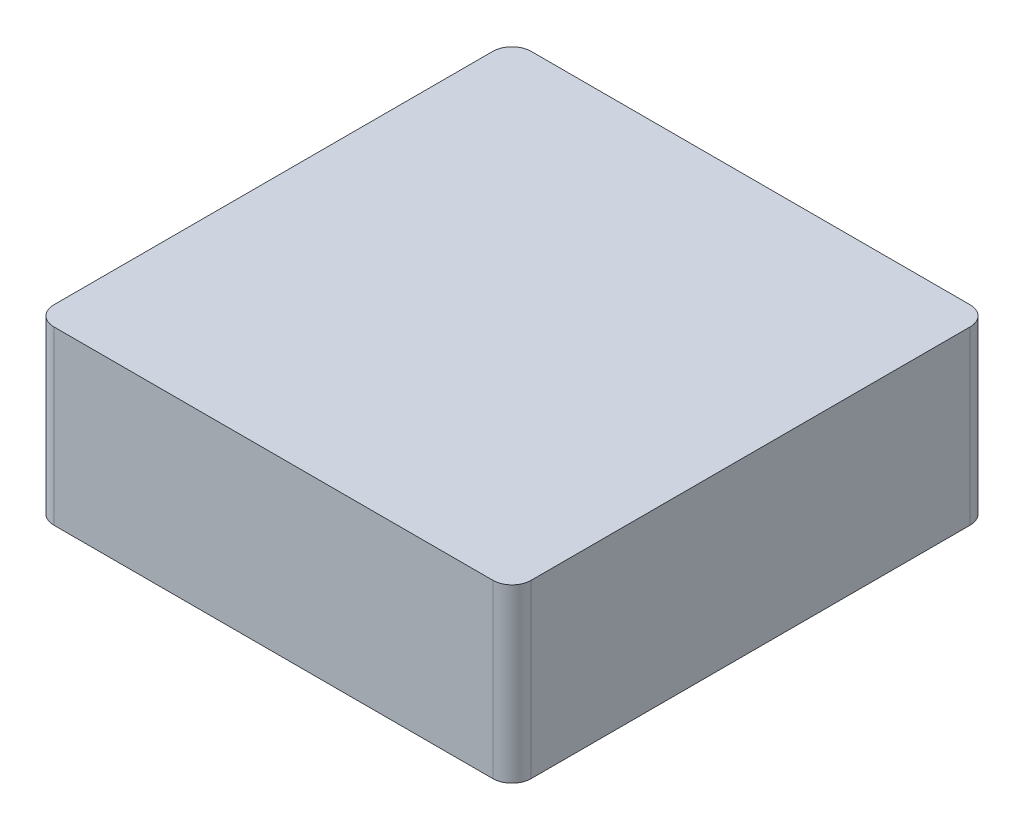
ISO-10303-21;
HEADER;
FILE_DESCRIPTION(('STEP AP214'),'2;1');
FILE_NAME('part.step','',(''),(''),'','','');
FILE_SCHEMA(('AUTOMOTIVE_DESIGN { 1 0 10303 214 1 1 1 1 }'));
ENDSEC;
DATA;
#1=APPLICATION_CONTEXT('core data for automotive mechanical design processes');
#2=APPLICATION_PROTOCOL_DEFINITION('international standard','automotive_design',2000,#1);
#3=PRODUCT_CONTEXT('',#1,'mechanical');
#4=PRODUCT('Part','Part','',(#3));
#5=PRODUCT_RELATED_PRODUCT_CATEGORY('part','',(#4));
#6=PRODUCT_DEFINITION_FORMATION('','',#4);
#7=PRODUCT_DEFINITION_CONTEXT('part definition',#1,'design');
#8=PRODUCT_DEFINITION('design','',#6,#7);
#9=PRODUCT_DEFINITION_SHAPE('','',#8);
#10=(LENGTH_UNIT() NAMED_UNIT(*) SI_UNIT(.MILLI.,.METRE.));
#11=(NAMED_UNIT(*) PLANE_ANGLE_UNIT() SI_UNIT($,.RADIAN.));
#12=(NAMED_UNIT(*) SI_UNIT($,.STERADIAN.) SOLID_ANGLE_UNIT());
#13=UNCERTAINTY_MEASURE_WITH_UNIT(LENGTH_MEASURE(1.E-05),#10,'distance_accuracy_value','');
#14=(GEOMETRIC_REPRESENTATION_CONTEXT(3) GLOBAL_UNCERTAINTY_ASSIGNED_CONTEXT((#13)) GLOBAL_UNIT_ASSIGNED_CONTEXT((#10,
#11,#12)) REPRESENTATION_CONTEXT('',''));
#15=CARTESIAN_POINT('',(0.,0.,0.));
#16=DIRECTION('',(0.,0.,1.));
#17=DIRECTION('',(1.,0.,0.));
#18=AXIS2_PLACEMENT_3D('',#15,#16,#17);
#19=CARTESIAN_POINT('',(-12.5,9.,12.5));
#20=DIRECTION('',(1.,0.,0.));
#21=DIRECTION('',(0.,0.,-1.));
#22=AXIS2_PLACEMENT_3D('',#19,#20,#21);
#23=PLANE('',#22);
#24=DIRECTION('',(0.,0.,1.));
#25=VECTOR('',#24,1.);
#26=CARTESIAN_POINT('',(-12.5,9.,12.5));
#27=LINE('',#26,#25);
#28=CARTESIAN_POINT('',(-12.5,9.,-11.5));
#29=VERTEX_POINT('',#28);
#30=CARTESIAN_POINT('',(-12.5,9.,11.5));
#31=VERTEX_POINT('',#30);
#32=EDGE_CURVE('E129',#29,#31,#27,.T.);
#33=ORIENTED_EDGE('',*,*,#32,.F.);
#34=DIRECTION('',(0.,-1.,0.));
#35=VECTOR('',#34,1.);
#36=CARTESIAN_POINT('',(-12.5,9.,-11.5));
#37=LINE('',#36,#35);
#38=CARTESIAN_POINT('',(-12.5,0.,-11.5));
#39=VERTEX_POINT('',#38);
#40=EDGE_CURVE('E11',#29,#39,#37,.T.);
#41=ORIENTED_EDGE('',*,*,#40,.T.);
#42=DIRECTION('',(0.,0.,1.));
#43=VECTOR('',#42,1.);
#44=CARTESIAN_POINT('',(-12.5,0.,12.5));
#45=LINE('',#44,#43);
#46=CARTESIAN_POINT('',(-12.5,0.,11.5));
#47=VERTEX_POINT('',#46);
#48=EDGE_CURVE('E160',#39,#47,#45,.T.);
#49=ORIENTED_EDGE('',*,*,#48,.T.);
#50=DIRECTION('',(0.,-1.,0.));
#51=VECTOR('',#50,1.);
#52=CARTESIAN_POINT('',(-12.5,9.,11.5));
#53=LINE('',#52,#51);
#54=EDGE_CURVE('E43',#47,#31,#53,.F.);
#55=ORIENTED_EDGE('',*,*,#54,.T.);
#56=EDGE_LOOP('',(#33,#41,#49,#55));
#57=FACE_BOUND('',#56,.T.);
#58=ADVANCED_FACE('F35',(#57),#23,.F.);
#59=CARTESIAN_POINT('',(-12.5,9.,12.5));
#60=DIRECTION('',(0.,0.,-1.));
#61=DIRECTION('',(-1.,0.,0.));
#62=AXIS2_PLACEMENT_3D('',#59,#60,#61);
#63=PLANE('',#62);
#64=DIRECTION('',(1.,0.,0.));
#65=VECTOR('',#64,1.);
#66=CARTESIAN_POINT('',(-12.5,0.,12.5));
#67=LINE('',#66,#65);
#68=CARTESIAN_POINT('',(-11.5,0.,12.5));
#69=VERTEX_POINT('',#68);
#70=CARTESIAN_POINT('',(11.5,0.,12.5));
#71=VERTEX_POINT('',#70);
#72=EDGE_CURVE('E134',#69,#71,#67,.T.);
#73=ORIENTED_EDGE('',*,*,#72,.T.);
#74=DIRECTION('',(0.,-1.,0.));
#75=VECTOR('',#74,1.);
#76=CARTESIAN_POINT('',(11.5,9.,12.5));
#77=LINE('',#76,#75);
#78=CARTESIAN_POINT('',(11.5,9.,12.5));
#79=VERTEX_POINT('',#78);
#80=EDGE_CURVE('E50',#71,#79,#77,.F.);
#81=ORIENTED_EDGE('',*,*,#80,.T.);
#82=DIRECTION('',(1.,0.,0.));
#83=VECTOR('',#82,1.);
#84=CARTESIAN_POINT('',(-12.5,9.,12.5));
#85=LINE('',#84,#83);
#86=CARTESIAN_POINT('',(-11.5,9.,12.5));
#87=VERTEX_POINT('',#86);
#88=EDGE_CURVE('E132',#87,#79,#85,.T.);
#89=ORIENTED_EDGE('',*,*,#88,.F.);
#90=DIRECTION('',(0.,-1.,0.));
#91=VECTOR('',#90,1.);
#92=CARTESIAN_POINT('',(-11.5,9.,12.5));
#93=LINE('',#92,#91);
#94=EDGE_CURVE('E152',#87,#69,#93,.T.);
#95=ORIENTED_EDGE('',*,*,#94,.T.);
#96=EDGE_LOOP('',(#73,#81,#89,#95));
#97=FACE_BOUND('',#96,.T.);
#98=ADVANCED_FACE('F167',(#97),#63,.F.);
#99=CARTESIAN_POINT('',(12.5,9.,12.5));
#100=DIRECTION('',(-1.,0.,0.));
#101=DIRECTION('',(0.,0.,1.));
#102=AXIS2_PLACEMENT_3D('',#99,#100,#101);
#103=PLANE('',#102);
#104=DIRECTION('',(0.,0.,-1.));
#105=VECTOR('',#104,1.);
#106=CARTESIAN_POINT('',(12.5,0.,12.5));
#107=LINE('',#106,#105);
#108=CARTESIAN_POINT('',(12.5,0.,11.5));
#109=VERTEX_POINT('',#108);
#110=CARTESIAN_POINT('',(12.5,0.,-11.5));
#111=VERTEX_POINT('',#110);
#112=EDGE_CURVE('E130',#109,#111,#107,.T.);
#113=ORIENTED_EDGE('',*,*,#112,.T.);
#114=DIRECTION('',(0.,-1.,0.));
#115=VECTOR('',#114,1.);
#116=CARTESIAN_POINT('',(12.5,9.,-11.5));
#117=LINE('',#116,#115);
#118=CARTESIAN_POINT('',(12.5,9.,-11.5));
#119=VERTEX_POINT('',#118);
#120=EDGE_CURVE('E107',#111,#119,#117,.F.);
#121=ORIENTED_EDGE('',*,*,#120,.T.);
#122=DIRECTION('',(0.,0.,-1.));
#123=VECTOR('',#122,1.);
#124=CARTESIAN_POINT('',(12.5,9.,12.5));
#125=LINE('',#124,#123);
#126=CARTESIAN_POINT('',(12.5,9.,11.5));
#127=VERTEX_POINT('',#126);
#128=EDGE_CURVE('E171',#127,#119,#125,.T.);
#129=ORIENTED_EDGE('',*,*,#128,.F.);
#130=DIRECTION('',(0.,-1.,0.));
#131=VECTOR('',#130,1.);
#132=CARTESIAN_POINT('',(12.5,9.,11.5));
#133=LINE('',#132,#131);
#134=EDGE_CURVE('E112',#127,#109,#133,.T.);
#135=ORIENTED_EDGE('',*,*,#134,.T.);
#136=EDGE_LOOP('',(#113,#121,#129,#135));
#137=FACE_BOUND('',#136,.T.);
#138=ADVANCED_FACE('F179',(#137),#103,.F.);
#139=CARTESIAN_POINT('',(-12.5,9.,-12.5));
#140=DIRECTION('',(0.,0.,1.));
#141=DIRECTION('',(1.,0.,0.));
#142=AXIS2_PLACEMENT_3D('',#139,#140,#141);
#143=PLANE('',#142);
#144=DIRECTION('',(-1.,0.,0.));
#145=VECTOR('',#144,1.);
#146=CARTESIAN_POINT('',(-12.5,9.,-12.5));
#147=LINE('',#146,#145);
#148=CARTESIAN_POINT('',(11.5,9.,-12.5));
#149=VERTEX_POINT('',#148);
#150=CARTESIAN_POINT('',(-11.5,9.,-12.5));
#151=VERTEX_POINT('',#150);
#152=EDGE_CURVE('E122',#149,#151,#147,.T.);
#153=ORIENTED_EDGE('',*,*,#152,.F.);
#154=DIRECTION('',(0.,-1.,0.));
#155=VECTOR('',#154,1.);
#156=CARTESIAN_POINT('',(11.5,9.,-12.5));
#157=LINE('',#156,#155);
#158=CARTESIAN_POINT('',(11.5,0.,-12.5));
#159=VERTEX_POINT('',#158);
#160=EDGE_CURVE('E106',#149,#159,#157,.T.);
#161=ORIENTED_EDGE('',*,*,#160,.T.);
#162=DIRECTION('',(-1.,0.,0.));
#163=VECTOR('',#162,1.);
#164=CARTESIAN_POINT('',(-12.5,0.,-12.5));
#165=LINE('',#164,#163);
#166=CARTESIAN_POINT('',(-11.5,0.,-12.5));
#167=VERTEX_POINT('',#166);
#168=EDGE_CURVE('E119',#159,#167,#165,.T.);
#169=ORIENTED_EDGE('',*,*,#168,.T.);
#170=DIRECTION('',(0.,-1.,0.));
#171=VECTOR('',#170,1.);
#172=CARTESIAN_POINT('',(-11.5,9.,-12.5));
#173=LINE('',#172,#171);
#174=EDGE_CURVE('E124',#167,#151,#173,.F.);
#175=ORIENTED_EDGE('',*,*,#174,.T.);
#176=EDGE_LOOP('',(#153,#161,#169,#175));
#177=FACE_BOUND('',#176,.T.);
#178=ADVANCED_FACE('F118',(#177),#143,.F.);
#179=CARTESIAN_POINT('',(0.,9.,0.));
#180=DIRECTION('',(0.,-1.,0.));
#181=DIRECTION('',(0.,0.,-1.));
#182=AXIS2_PLACEMENT_3D('',#179,#180,#181);
#183=PLANE('',#182);
#184=ORIENTED_EDGE('',*,*,#128,.T.);
#185=CARTESIAN_POINT('',(11.5,9.,-11.5));
#186=DIRECTION('',(0.,-1.,0.));
#187=DIRECTION('',(0.,0.,-1.));
#188=AXIS2_PLACEMENT_3D('',#185,#186,#187);
#189=CIRCLE('',#188,1.);
#190=EDGE_CURVE('E150',#119,#149,#189,.F.);
#191=ORIENTED_EDGE('',*,*,#190,.T.);
#192=ORIENTED_EDGE('',*,*,#152,.T.);
#193=CARTESIAN_POINT('',(-11.5,9.,-11.5));
#194=DIRECTION('',(0.,-1.,0.));
#195=DIRECTION('',(0.,0.,-1.));
#196=AXIS2_PLACEMENT_3D('',#193,#194,#195);
#197=CIRCLE('',#196,1.);
#198=EDGE_CURVE('E146',#151,#29,#197,.F.);
#199=ORIENTED_EDGE('',*,*,#198,.T.);
#200=ORIENTED_EDGE('',*,*,#32,.T.);
#201=CARTESIAN_POINT('',(-11.5,9.,11.5));
#202=DIRECTION('',(0.,-1.,0.));
#203=DIRECTION('',(0.,0.,-1.));
#204=AXIS2_PLACEMENT_3D('',#201,#202,#203);
#205=CIRCLE('',#204,1.);
#206=EDGE_CURVE('E57',#31,#87,#205,.F.);
#207=ORIENTED_EDGE('',*,*,#206,.T.);
#208=ORIENTED_EDGE('',*,*,#88,.T.);
#209=CARTESIAN_POINT('',(11.5,9.,11.5));
#210=DIRECTION('',(0.,-1.,0.));
#211=DIRECTION('',(0.,0.,-1.));
#212=AXIS2_PLACEMENT_3D('',#209,#210,#211);
#213=CIRCLE('',#212,1.);
#214=EDGE_CURVE('E148',#79,#127,#213,.F.);
#215=ORIENTED_EDGE('',*,*,#214,.T.);
#216=EDGE_LOOP('',(#184,#191,#192,#199,#200,#207,#208,#215));
#217=FACE_BOUND('',#216,.T.);
#218=ADVANCED_FACE('F163',(#217),#183,.F.);
#219=CARTESIAN_POINT('',(0.,0.,0.));
#220=DIRECTION('',(0.,-1.,0.));
#221=DIRECTION('',(0.,0.,-1.));
#222=AXIS2_PLACEMENT_3D('',#219,#220,#221);
#223=PLANE('',#222);
#224=ORIENTED_EDGE('',*,*,#168,.F.);
#225=CARTESIAN_POINT('',(11.5,0.,-11.5));
#226=DIRECTION('',(0.,-1.,0.));
#227=DIRECTION('',(0.,0.,-1.));
#228=AXIS2_PLACEMENT_3D('',#225,#226,#227);
#229=CIRCLE('',#228,1.);
#230=EDGE_CURVE('E102',#159,#111,#229,.T.);
#231=ORIENTED_EDGE('',*,*,#230,.T.);
#232=ORIENTED_EDGE('',*,*,#112,.F.);
#233=CARTESIAN_POINT('',(11.5,0.,11.5));
#234=DIRECTION('',(0.,-1.,0.));
#235=DIRECTION('',(0.,0.,-1.));
#236=AXIS2_PLACEMENT_3D('',#233,#234,#235);
#237=CIRCLE('',#236,1.);
#238=EDGE_CURVE('E113',#109,#71,#237,.T.);
#239=ORIENTED_EDGE('',*,*,#238,.T.);
#240=ORIENTED_EDGE('',*,*,#72,.F.);
#241=CARTESIAN_POINT('',(-11.5,0.,11.5));
#242=DIRECTION('',(0.,-1.,0.));
#243=DIRECTION('',(0.,0.,-1.));
#244=AXIS2_PLACEMENT_3D('',#241,#242,#243);
#245=CIRCLE('',#244,1.);
#246=EDGE_CURVE('E123',#69,#47,#245,.T.);
#247=ORIENTED_EDGE('',*,*,#246,.T.);
#248=ORIENTED_EDGE('',*,*,#48,.F.);
#249=CARTESIAN_POINT('',(-11.5,0.,-11.5));
#250=DIRECTION('',(0.,-1.,0.));
#251=DIRECTION('',(0.,0.,-1.));
#252=AXIS2_PLACEMENT_3D('',#249,#250,#251);
#253=CIRCLE('',#252,1.);
#254=EDGE_CURVE('E128',#39,#167,#253,.T.);
#255=ORIENTED_EDGE('',*,*,#254,.T.);
#256=EDGE_LOOP('',(#224,#231,#232,#239,#240,#247,#248,#255));
#257=FACE_BOUND('',#256,.T.);
#258=ADVANCED_FACE('F126',(#257),#223,.T.);
#259=CARTESIAN_POINT('',(11.5,9.,-11.5));
#260=DIRECTION('',(0.,-1.,0.));
#261=DIRECTION('',(0.,0.,-1.));
#262=AXIS2_PLACEMENT_3D('',#259,#260,#261);
#263=CYLINDRICAL_SURFACE('',#262,1.);
#264=ORIENTED_EDGE('',*,*,#190,.F.);
#265=ORIENTED_EDGE('',*,*,#120,.F.);
#266=ORIENTED_EDGE('',*,*,#230,.F.);
#267=ORIENTED_EDGE('',*,*,#160,.F.);
#268=EDGE_LOOP('',(#264,#265,#266,#267));
#269=FACE_BOUND('',#268,.T.);
#270=ADVANCED_FACE('F105',(#269),#263,.T.);
#271=CARTESIAN_POINT('',(11.5,9.,11.5));
#272=DIRECTION('',(0.,-1.,0.));
#273=DIRECTION('',(0.,0.,-1.));
#274=AXIS2_PLACEMENT_3D('',#271,#272,#273);
#275=CYLINDRICAL_SURFACE('',#274,1.);
#276=ORIENTED_EDGE('',*,*,#214,.F.);
#277=ORIENTED_EDGE('',*,*,#80,.F.);
#278=ORIENTED_EDGE('',*,*,#238,.F.);
#279=ORIENTED_EDGE('',*,*,#134,.F.);
#280=EDGE_LOOP('',(#276,#277,#278,#279));
#281=FACE_BOUND('',#280,.T.);
#282=ADVANCED_FACE('F177',(#281),#275,.T.);
#283=CARTESIAN_POINT('',(-11.5,9.,-11.5));
#284=DIRECTION('',(0.,-1.,0.));
#285=DIRECTION('',(0.,0.,-1.));
#286=AXIS2_PLACEMENT_3D('',#283,#284,#285);
#287=CYLINDRICAL_SURFACE('',#286,1.);
#288=ORIENTED_EDGE('',*,*,#198,.F.);
#289=ORIENTED_EDGE('',*,*,#174,.F.);
#290=ORIENTED_EDGE('',*,*,#254,.F.);
#291=ORIENTED_EDGE('',*,*,#40,.F.);
#292=EDGE_LOOP('',(#288,#289,#290,#291));
#293=FACE_BOUND('',#292,.T.);
#294=ADVANCED_FACE('F181',(#293),#287,.T.);
#295=CARTESIAN_POINT('',(-11.5,9.,11.5));
#296=DIRECTION('',(0.,-1.,0.));
#297=DIRECTION('',(0.,0.,-1.));
#298=AXIS2_PLACEMENT_3D('',#295,#296,#297);
#299=CYLINDRICAL_SURFACE('',#298,1.);
#300=ORIENTED_EDGE('',*,*,#206,.F.);
#301=ORIENTED_EDGE('',*,*,#54,.F.);
#302=ORIENTED_EDGE('',*,*,#246,.F.);
#303=ORIENTED_EDGE('',*,*,#94,.F.);
#304=EDGE_LOOP('',(#300,#301,#302,#303));
#305=FACE_BOUND('',#304,.T.);
#306=ADVANCED_FACE('F37',(#305),#299,.T.);
#307=CLOSED_SHELL('',(#58,#98,#138,#178,#218,#258,#270,#282,#294,#306));
#308=MANIFOLD_SOLID_BREP('B2',#307);
#309=ADVANCED_BREP_SHAPE_REPRESENTATION('',(#18,#308),#14);
#310=SHAPE_DEFINITION_REPRESENTATION(#9,#309);
ENDSEC;
END-ISO-10303-21;
